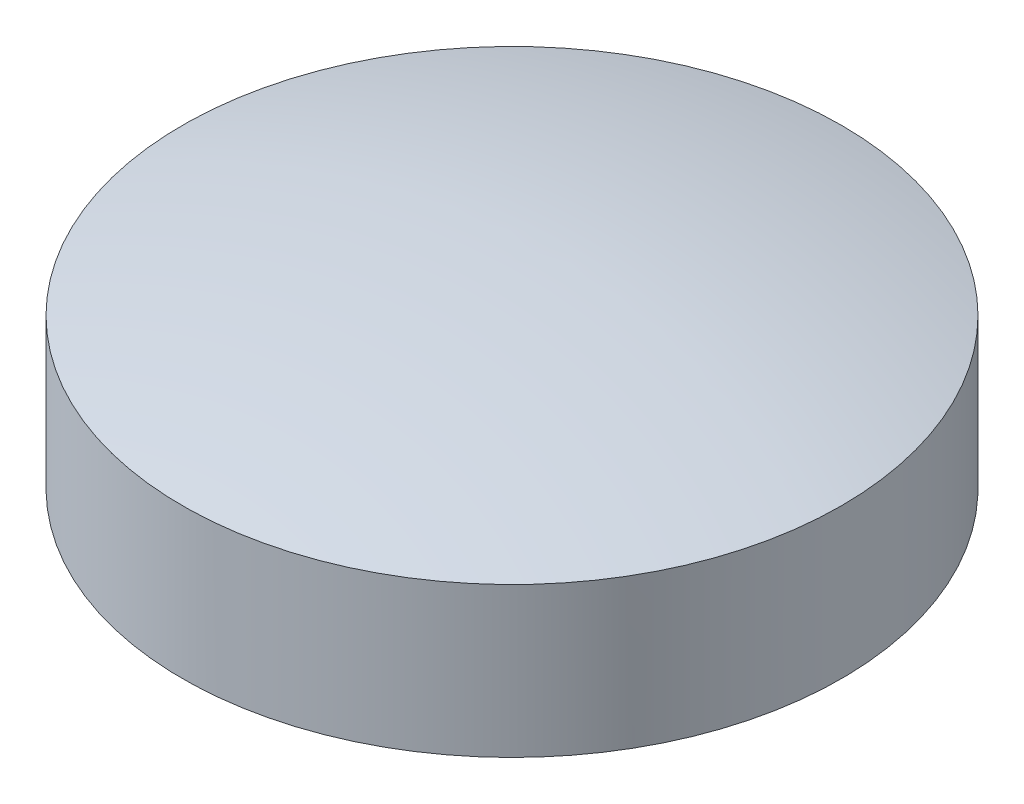
ISO-10303-21;
HEADER;
FILE_DESCRIPTION(('STEP AP214'),'2;1');
FILE_NAME('part.step','',(''),(''),'','','');
FILE_SCHEMA(('AUTOMOTIVE_DESIGN { 1 0 10303 214 1 1 1 1 }'));
ENDSEC;
DATA;
#1=APPLICATION_CONTEXT('core data for automotive mechanical design processes');
#2=APPLICATION_PROTOCOL_DEFINITION('international standard','automotive_design',2000,#1);
#3=PRODUCT_CONTEXT('',#1,'mechanical');
#4=PRODUCT('Part','Part','',(#3));
#5=PRODUCT_RELATED_PRODUCT_CATEGORY('part','',(#4));
#6=PRODUCT_DEFINITION_FORMATION('','',#4);
#7=PRODUCT_DEFINITION_CONTEXT('part definition',#1,'design');
#8=PRODUCT_DEFINITION('design','',#6,#7);
#9=PRODUCT_DEFINITION_SHAPE('','',#8);
#10=(LENGTH_UNIT() NAMED_UNIT(*) SI_UNIT(.MILLI.,.METRE.));
#11=(NAMED_UNIT(*) PLANE_ANGLE_UNIT() SI_UNIT($,.RADIAN.));
#12=(NAMED_UNIT(*) SI_UNIT($,.STERADIAN.) SOLID_ANGLE_UNIT());
#13=UNCERTAINTY_MEASURE_WITH_UNIT(LENGTH_MEASURE(1.E-05),#10,'distance_accuracy_value','');
#14=(GEOMETRIC_REPRESENTATION_CONTEXT(3) GLOBAL_UNCERTAINTY_ASSIGNED_CONTEXT((#13)) GLOBAL_UNIT_ASSIGNED_CONTEXT((#10,
#11,#12)) REPRESENTATION_CONTEXT('',''));
#15=CARTESIAN_POINT('',(0.,0.,0.));
#16=DIRECTION('',(0.,0.,1.));
#17=DIRECTION('',(1.,0.,0.));
#18=AXIS2_PLACEMENT_3D('',#15,#16,#17);
#19=CARTESIAN_POINT('',(0.,-69.1666666666667,0.));
#20=DIRECTION('',(0.,-1.,0.));
#21=DIRECTION('',(1.,0.,0.));
#22=AXIS2_PLACEMENT_3D('',#19,#20,#21);
#23=SPHERICAL_SURFACE('',#22,82.1666666666667);
#24=CARTESIAN_POINT('',(0.,10.,0.));
#25=DIRECTION('',(0.,-1.,0.));
#26=DIRECTION('',(0.,0.,-1.));
#27=AXIS2_PLACEMENT_3D('',#24,#25,#26);
#28=CIRCLE('',#27,22.);
#29=CARTESIAN_POINT('',(0.,10.,-22.));
#30=VERTEX_POINT('',#29);
#31=EDGE_CURVE('E10',#30,#30,#28,.T.);
#32=ORIENTED_EDGE('',*,*,#31,.F.);
#33=EDGE_LOOP('',(#32));
#34=FACE_BOUND('',#33,.T.);
#35=ADVANCED_FACE('F31',(#34),#23,.T.);
#36=CARTESIAN_POINT('',(0.,0.,0.));
#37=DIRECTION('',(0.,-1.,0.));
#38=DIRECTION('',(0.,0.,-1.));
#39=AXIS2_PLACEMENT_3D('',#36,#37,#38);
#40=CYLINDRICAL_SURFACE('',#39,22.);
#41=ORIENTED_EDGE('',*,*,#31,.T.);
#42=EDGE_LOOP('',(#41));
#43=FACE_BOUND('',#42,.T.);
#44=CARTESIAN_POINT('',(0.,0.,0.));
#45=DIRECTION('',(0.,-1.,0.));
#46=DIRECTION('',(0.,0.,-1.));
#47=AXIS2_PLACEMENT_3D('',#44,#45,#46);
#48=CIRCLE('',#47,22.);
#49=CARTESIAN_POINT('',(0.,0.,-22.));
#50=VERTEX_POINT('',#49);
#51=EDGE_CURVE('E37',#50,#50,#48,.T.);
#52=ORIENTED_EDGE('',*,*,#51,.F.);
#53=EDGE_LOOP('',(#52));
#54=FACE_BOUND('',#53,.T.);
#55=ADVANCED_FACE('F45',(#43,#54),#40,.T.);
#56=CARTESIAN_POINT('',(0.,0.,0.));
#57=DIRECTION('',(0.,-1.,0.));
#58=DIRECTION('',(0.,0.,-1.));
#59=AXIS2_PLACEMENT_3D('',#56,#57,#58);
#60=PLANE('',#59);
#61=ORIENTED_EDGE('',*,*,#51,.T.);
#62=EDGE_LOOP('',(#61));
#63=FACE_BOUND('',#62,.T.);
#64=ADVANCED_FACE('F43',(#63),#60,.T.);
#65=CLOSED_SHELL('',(#35,#55,#64));
#66=MANIFOLD_SOLID_BREP('B2',#65);
#67=ADVANCED_BREP_SHAPE_REPRESENTATION('',(#18,#66),#14);
#68=SHAPE_DEFINITION_REPRESENTATION(#9,#67);
ENDSEC;
END-ISO-10303-21;
